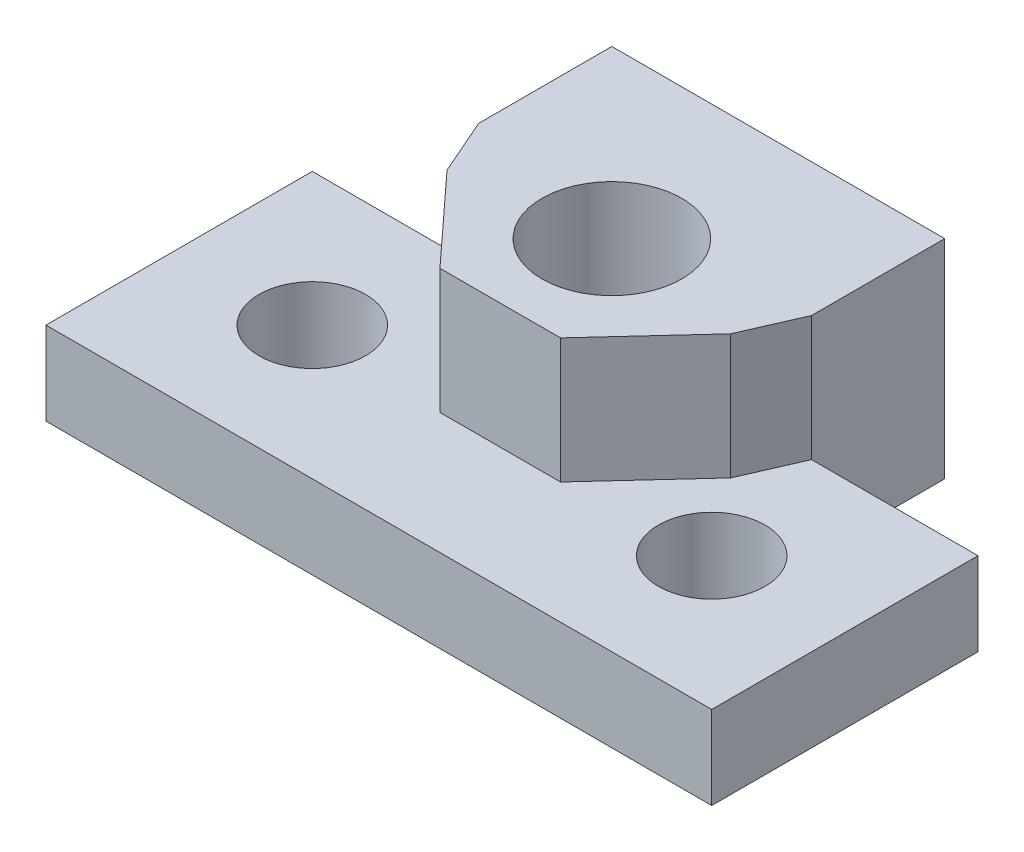
ISO-10303-21;
HEADER;
FILE_DESCRIPTION(('STEP AP214'),'2;1');
FILE_NAME('part.step','',(''),(''),'','','');
FILE_SCHEMA(('AUTOMOTIVE_DESIGN { 1 0 10303 214 1 1 1 1 }'));
ENDSEC;
DATA;
#1=APPLICATION_CONTEXT('core data for automotive mechanical design processes');
#2=APPLICATION_PROTOCOL_DEFINITION('international standard','automotive_design',2000,#1);
#3=PRODUCT_CONTEXT('',#1,'mechanical');
#4=PRODUCT('Part','Part','',(#3));
#5=PRODUCT_RELATED_PRODUCT_CATEGORY('part','',(#4));
#6=PRODUCT_DEFINITION_FORMATION('','',#4);
#7=PRODUCT_DEFINITION_CONTEXT('part definition',#1,'design');
#8=PRODUCT_DEFINITION('design','',#6,#7);
#9=PRODUCT_DEFINITION_SHAPE('','',#8);
#10=(LENGTH_UNIT() NAMED_UNIT(*) SI_UNIT(.MILLI.,.METRE.));
#11=(NAMED_UNIT(*) PLANE_ANGLE_UNIT() SI_UNIT($,.RADIAN.));
#12=(NAMED_UNIT(*) SI_UNIT($,.STERADIAN.) SOLID_ANGLE_UNIT());
#13=UNCERTAINTY_MEASURE_WITH_UNIT(LENGTH_MEASURE(1.E-05),#10,'distance_accuracy_value','');
#14=(GEOMETRIC_REPRESENTATION_CONTEXT(3) GLOBAL_UNCERTAINTY_ASSIGNED_CONTEXT((#13)) GLOBAL_UNIT_ASSIGNED_CONTEXT((#10,
#11,#12)) REPRESENTATION_CONTEXT('',''));
#15=CARTESIAN_POINT('',(0.,0.,0.));
#16=DIRECTION('',(0.,0.,1.));
#17=DIRECTION('',(1.,0.,0.));
#18=AXIS2_PLACEMENT_3D('',#15,#16,#17);
#19=CARTESIAN_POINT('',(0.,1.25,0.));
#20=DIRECTION('',(0.,1.,0.));
#21=DIRECTION('',(0.,0.,1.));
#22=AXIS2_PLACEMENT_3D('',#19,#20,#21);
#23=PLANE('',#22);
#24=CARTESIAN_POINT('',(-6.,1.25,5.66666666666666));
#25=DIRECTION('',(0.,1.,0.));
#26=DIRECTION('',(0.,0.,1.));
#27=AXIS2_PLACEMENT_3D('',#24,#25,#26);
#28=CIRCLE('',#27,1.6);
#29=CARTESIAN_POINT('',(-6.,1.25,7.26666666666666));
#30=VERTEX_POINT('',#29);
#31=EDGE_CURVE('E197',#30,#30,#28,.T.);
#32=ORIENTED_EDGE('',*,*,#31,.F.);
#33=EDGE_LOOP('',(#32));
#34=FACE_BOUND('',#33,.T.);
#35=CARTESIAN_POINT('',(6.,1.25,5.66666666666666));
#36=DIRECTION('',(0.,1.,0.));
#37=DIRECTION('',(0.,0.,1.));
#38=AXIS2_PLACEMENT_3D('',#35,#36,#37);
#39=CIRCLE('',#38,1.6);
#40=CARTESIAN_POINT('',(6.,1.25,7.26666666666666));
#41=VERTEX_POINT('',#40);
#42=EDGE_CURVE('E191',#41,#41,#39,.T.);
#43=ORIENTED_EDGE('',*,*,#42,.F.);
#44=EDGE_LOOP('',(#43));
#45=FACE_BOUND('',#44,.T.);
#46=DIRECTION('',(-0.677056530820883,0.,-0.73593101176183));
#47=VECTOR('',#46,1.);
#48=CARTESIAN_POINT('',(-3.9806682086731,1.25,3.66221475197925));
#49=LINE('',#48,#47);
#50=CARTESIAN_POINT('',(-1.81082534023711,1.25,6.0207396089749));
#51=VERTEX_POINT('',#50);
#52=CARTESIAN_POINT('',(-4.26076550644025,1.25,3.35776116744974));
#53=VERTEX_POINT('',#52);
#54=EDGE_CURVE('E11',#51,#53,#49,.T.);
#55=ORIENTED_EDGE('',*,*,#54,.T.);
#56=DIRECTION('',(-0.400537147265651,0.,-0.916280521270803));
#57=VECTOR('',#56,1.);
#58=CARTESIAN_POINT('',(-4.80952394510962,1.25,2.10240527432396));
#59=LINE('',#58,#57);
#60=CARTESIAN_POINT('',(-5.,1.25,1.66666666666666));
#61=VERTEX_POINT('',#60);
#62=EDGE_CURVE('E185',#53,#61,#59,.T.);
#63=ORIENTED_EDGE('',*,*,#62,.T.);
#64=DIRECTION('',(-1.,0.,0.));
#65=VECTOR('',#64,1.);
#66=CARTESIAN_POINT('',(-5.,1.25,1.66666666666666));
#67=LINE('',#66,#65);
#68=CARTESIAN_POINT('',(-10.,1.25,1.66666666666666));
#69=VERTEX_POINT('',#68);
#70=EDGE_CURVE('E203',#61,#69,#67,.T.);
#71=ORIENTED_EDGE('',*,*,#70,.T.);
#72=DIRECTION('',(0.,0.,1.));
#73=VECTOR('',#72,1.);
#74=CARTESIAN_POINT('',(-10.,1.25,1.66666666666666));
#75=LINE('',#74,#73);
#76=CARTESIAN_POINT('',(-10.,1.25,9.66666666666666));
#77=VERTEX_POINT('',#76);
#78=EDGE_CURVE('E205',#69,#77,#75,.T.);
#79=ORIENTED_EDGE('',*,*,#78,.T.);
#80=DIRECTION('',(1.,0.,0.));
#81=VECTOR('',#80,1.);
#82=CARTESIAN_POINT('',(-10.,1.25,9.66666666666666));
#83=LINE('',#82,#81);
#84=CARTESIAN_POINT('',(10.,1.25,9.66666666666666));
#85=VERTEX_POINT('',#84);
#86=EDGE_CURVE('E207',#77,#85,#83,.T.);
#87=ORIENTED_EDGE('',*,*,#86,.T.);
#88=DIRECTION('',(0.,0.,-1.));
#89=VECTOR('',#88,1.);
#90=CARTESIAN_POINT('',(10.,1.25,9.66666666666666));
#91=LINE('',#90,#89);
#92=CARTESIAN_POINT('',(10.,1.25,1.66666666666666));
#93=VERTEX_POINT('',#92);
#94=EDGE_CURVE('E209',#85,#93,#91,.T.);
#95=ORIENTED_EDGE('',*,*,#94,.T.);
#96=DIRECTION('',(-1.,0.,0.));
#97=VECTOR('',#96,1.);
#98=CARTESIAN_POINT('',(10.,1.25,1.66666666666666));
#99=LINE('',#98,#97);
#100=CARTESIAN_POINT('',(5.,1.25,1.66666666666666));
#101=VERTEX_POINT('',#100);
#102=EDGE_CURVE('E134',#93,#101,#99,.T.);
#103=ORIENTED_EDGE('',*,*,#102,.T.);
#104=DIRECTION('',(-0.400537147265651,0.,0.916280521270803));
#105=VECTOR('',#104,1.);
#106=CARTESIAN_POINT('',(4.80952394510962,1.25,2.10240527432396));
#107=LINE('',#106,#105);
#108=CARTESIAN_POINT('',(4.26076550644025,1.25,3.35776116744974));
#109=VERTEX_POINT('',#108);
#110=EDGE_CURVE('E183',#101,#109,#107,.T.);
#111=ORIENTED_EDGE('',*,*,#110,.T.);
#112=DIRECTION('',(-0.677056530820883,0.,0.73593101176183));
#113=VECTOR('',#112,1.);
#114=CARTESIAN_POINT('',(3.9806682086731,1.25,3.66221475197925));
#115=LINE('',#114,#113);
#116=CARTESIAN_POINT('',(1.81082534023711,1.25,6.0207396089749));
#117=VERTEX_POINT('',#116);
#118=EDGE_CURVE('E248',#109,#117,#115,.T.);
#119=ORIENTED_EDGE('',*,*,#118,.T.);
#120=DIRECTION('',(-1.,0.,0.));
#121=VECTOR('',#120,1.);
#122=CARTESIAN_POINT('',(0.,1.25,6.0207396089749));
#123=LINE('',#122,#121);
#124=EDGE_CURVE('E41',#117,#51,#123,.T.);
#125=ORIENTED_EDGE('',*,*,#124,.T.);
#126=EDGE_LOOP('',(#55,#63,#71,#79,#87,#95,#103,#111,#119,#125));
#127=FACE_BOUND('',#126,.T.);
#128=ADVANCED_FACE('F33',(#34,#45,#127),#23,.T.);
#129=CARTESIAN_POINT('',(0.,-1.25,0.));
#130=DIRECTION('',(0.,1.,0.));
#131=DIRECTION('',(0.,0.,1.));
#132=AXIS2_PLACEMENT_3D('',#129,#130,#131);
#133=PLANE('',#132);
#134=DIRECTION('',(0.,0.,1.));
#135=VECTOR('',#134,1.);
#136=CARTESIAN_POINT('',(-5.,-1.25,1.66666666666666));
#137=LINE('',#136,#135);
#138=CARTESIAN_POINT('',(-5.,-1.25,-2.33333333333334));
#139=VERTEX_POINT('',#138);
#140=CARTESIAN_POINT('',(-5.,-1.25,1.66666666666666));
#141=VERTEX_POINT('',#140);
#142=EDGE_CURVE('E200',#139,#141,#137,.T.);
#143=ORIENTED_EDGE('',*,*,#142,.F.);
#144=DIRECTION('',(-1.,0.,0.));
#145=VECTOR('',#144,1.);
#146=CARTESIAN_POINT('',(5.,-1.25,-2.33333333333334));
#147=LINE('',#146,#145);
#148=CARTESIAN_POINT('',(5.,-1.25,-2.33333333333334));
#149=VERTEX_POINT('',#148);
#150=EDGE_CURVE('E129',#149,#139,#147,.T.);
#151=ORIENTED_EDGE('',*,*,#150,.F.);
#152=DIRECTION('',(0.,0.,-1.));
#153=VECTOR('',#152,1.);
#154=CARTESIAN_POINT('',(5.,-1.25,1.66666666666666));
#155=LINE('',#154,#153);
#156=CARTESIAN_POINT('',(5.,-1.25,1.66666666666666));
#157=VERTEX_POINT('',#156);
#158=EDGE_CURVE('E224',#157,#149,#155,.T.);
#159=ORIENTED_EDGE('',*,*,#158,.F.);
#160=DIRECTION('',(-1.,0.,0.));
#161=VECTOR('',#160,1.);
#162=CARTESIAN_POINT('',(10.,-1.25,1.66666666666666));
#163=LINE('',#162,#161);
#164=CARTESIAN_POINT('',(10.,-1.25,1.66666666666666));
#165=VERTEX_POINT('',#164);
#166=EDGE_CURVE('E221',#165,#157,#163,.T.);
#167=ORIENTED_EDGE('',*,*,#166,.F.);
#168=DIRECTION('',(0.,0.,-1.));
#169=VECTOR('',#168,1.);
#170=CARTESIAN_POINT('',(10.,-1.25,9.66666666666666));
#171=LINE('',#170,#169);
#172=CARTESIAN_POINT('',(10.,-1.25,9.66666666666666));
#173=VERTEX_POINT('',#172);
#174=EDGE_CURVE('E219',#173,#165,#171,.T.);
#175=ORIENTED_EDGE('',*,*,#174,.F.);
#176=DIRECTION('',(1.,0.,0.));
#177=VECTOR('',#176,1.);
#178=CARTESIAN_POINT('',(-10.,-1.25,9.66666666666666));
#179=LINE('',#178,#177);
#180=CARTESIAN_POINT('',(-10.,-1.25,9.66666666666666));
#181=VERTEX_POINT('',#180);
#182=EDGE_CURVE('E217',#181,#173,#179,.T.);
#183=ORIENTED_EDGE('',*,*,#182,.F.);
#184=DIRECTION('',(0.,0.,1.));
#185=VECTOR('',#184,1.);
#186=CARTESIAN_POINT('',(-10.,-1.25,1.66666666666666));
#187=LINE('',#186,#185);
#188=CARTESIAN_POINT('',(-10.,-1.25,1.66666666666666));
#189=VERTEX_POINT('',#188);
#190=EDGE_CURVE('E215',#189,#181,#187,.T.);
#191=ORIENTED_EDGE('',*,*,#190,.F.);
#192=DIRECTION('',(-1.,0.,0.));
#193=VECTOR('',#192,1.);
#194=CARTESIAN_POINT('',(-5.,-1.25,1.66666666666666));
#195=LINE('',#194,#193);
#196=EDGE_CURVE('E213',#141,#189,#195,.T.);
#197=ORIENTED_EDGE('',*,*,#196,.F.);
#198=EDGE_LOOP('',(#143,#151,#159,#167,#175,#183,#191,#197));
#199=FACE_BOUND('',#198,.T.);
#200=CARTESIAN_POINT('',(-6.,-1.25,5.66666666666666));
#201=DIRECTION('',(0.,1.,0.));
#202=DIRECTION('',(0.,0.,1.));
#203=AXIS2_PLACEMENT_3D('',#200,#201,#202);
#204=CIRCLE('',#203,1.6);
#205=CARTESIAN_POINT('',(-6.,-1.25,7.26666666666666));
#206=VERTEX_POINT('',#205);
#207=EDGE_CURVE('E194',#206,#206,#204,.T.);
#208=ORIENTED_EDGE('',*,*,#207,.T.);
#209=EDGE_LOOP('',(#208));
#210=FACE_BOUND('',#209,.T.);
#211=CARTESIAN_POINT('',(6.,-1.25,5.66666666666666));
#212=DIRECTION('',(0.,1.,0.));
#213=DIRECTION('',(0.,0.,1.));
#214=AXIS2_PLACEMENT_3D('',#211,#212,#213);
#215=CIRCLE('',#214,1.6);
#216=CARTESIAN_POINT('',(6.,-1.25,7.26666666666666));
#217=VERTEX_POINT('',#216);
#218=EDGE_CURVE('E190',#217,#217,#215,.T.);
#219=ORIENTED_EDGE('',*,*,#218,.T.);
#220=EDGE_LOOP('',(#219));
#221=FACE_BOUND('',#220,.T.);
#222=CARTESIAN_POINT('',(0.,-1.25,2.66666666666666));
#223=DIRECTION('',(0.,1.,0.));
#224=DIRECTION('',(0.,0.,1.));
#225=AXIS2_PLACEMENT_3D('',#222,#223,#224);
#226=CIRCLE('',#225,2.5);
#227=CARTESIAN_POINT('',(0.,-1.25,5.16666666666666));
#228=VERTEX_POINT('',#227);
#229=EDGE_CURVE('E187',#228,#228,#226,.T.);
#230=ORIENTED_EDGE('',*,*,#229,.T.);
#231=EDGE_LOOP('',(#230));
#232=FACE_BOUND('',#231,.T.);
#233=ADVANCED_FACE('F275',(#199,#210,#221,#232),#133,.F.);
#234=CARTESIAN_POINT('',(-5.,1.25,1.66666666666666));
#235=DIRECTION('',(1.,0.,0.));
#236=DIRECTION('',(0.,0.,-1.));
#237=AXIS2_PLACEMENT_3D('',#234,#235,#236);
#238=PLANE('',#237);
#239=ORIENTED_EDGE('',*,*,#142,.T.);
#240=DIRECTION('',(0.,-1.,0.));
#241=VECTOR('',#240,1.);
#242=CARTESIAN_POINT('',(-5.,1.25,1.66666666666666));
#243=LINE('',#242,#241);
#244=EDGE_CURVE('E243',#61,#141,#243,.T.);
#245=ORIENTED_EDGE('',*,*,#244,.F.);
#246=DIRECTION('',(0.,-1.,0.));
#247=VECTOR('',#246,1.);
#248=CARTESIAN_POINT('',(-5.,5.,1.66666666666666));
#249=LINE('',#248,#247);
#250=CARTESIAN_POINT('',(-5.,5.,1.66666666666666));
#251=VERTEX_POINT('',#250);
#252=EDGE_CURVE('E140',#251,#61,#249,.T.);
#253=ORIENTED_EDGE('',*,*,#252,.F.);
#254=DIRECTION('',(0.,0.,1.));
#255=VECTOR('',#254,1.);
#256=CARTESIAN_POINT('',(-5.,5.,-2.33333333333334));
#257=LINE('',#256,#255);
#258=CARTESIAN_POINT('',(-5.,5.,-2.33333333333334));
#259=VERTEX_POINT('',#258);
#260=EDGE_CURVE('E137',#259,#251,#257,.T.);
#261=ORIENTED_EDGE('',*,*,#260,.F.);
#262=DIRECTION('',(0.,-1.,0.));
#263=VECTOR('',#262,1.);
#264=CARTESIAN_POINT('',(-5.,1.25,-2.33333333333334));
#265=LINE('',#264,#263);
#266=EDGE_CURVE('E123',#259,#139,#265,.T.);
#267=ORIENTED_EDGE('',*,*,#266,.T.);
#268=EDGE_LOOP('',(#239,#245,#253,#261,#267));
#269=FACE_BOUND('',#268,.T.);
#270=ADVANCED_FACE('F35',(#269),#238,.F.);
#271=CARTESIAN_POINT('',(-5.,1.25,1.66666666666666));
#272=DIRECTION('',(0.,0.,1.));
#273=DIRECTION('',(1.,0.,0.));
#274=AXIS2_PLACEMENT_3D('',#271,#272,#273);
#275=PLANE('',#274);
#276=ORIENTED_EDGE('',*,*,#196,.T.);
#277=DIRECTION('',(0.,-1.,0.));
#278=VECTOR('',#277,1.);
#279=CARTESIAN_POINT('',(-10.,1.25,1.66666666666666));
#280=LINE('',#279,#278);
#281=EDGE_CURVE('E240',#69,#189,#280,.T.);
#282=ORIENTED_EDGE('',*,*,#281,.F.);
#283=ORIENTED_EDGE('',*,*,#70,.F.);
#284=ORIENTED_EDGE('',*,*,#244,.T.);
#285=EDGE_LOOP('',(#276,#282,#283,#284));
#286=FACE_BOUND('',#285,.T.);
#287=ADVANCED_FACE('F271',(#286),#275,.F.);
#288=CARTESIAN_POINT('',(-10.,1.25,1.66666666666666));
#289=DIRECTION('',(1.,0.,0.));
#290=DIRECTION('',(0.,0.,-1.));
#291=AXIS2_PLACEMENT_3D('',#288,#289,#290);
#292=PLANE('',#291);
#293=ORIENTED_EDGE('',*,*,#190,.T.);
#294=DIRECTION('',(0.,-1.,0.));
#295=VECTOR('',#294,1.);
#296=CARTESIAN_POINT('',(-10.,1.25,9.66666666666666));
#297=LINE('',#296,#295);
#298=EDGE_CURVE('E237',#77,#181,#297,.T.);
#299=ORIENTED_EDGE('',*,*,#298,.F.);
#300=ORIENTED_EDGE('',*,*,#78,.F.);
#301=ORIENTED_EDGE('',*,*,#281,.T.);
#302=EDGE_LOOP('',(#293,#299,#300,#301));
#303=FACE_BOUND('',#302,.T.);
#304=ADVANCED_FACE('F281',(#303),#292,.F.);
#305=CARTESIAN_POINT('',(-10.,1.25,9.66666666666666));
#306=DIRECTION('',(0.,0.,-1.));
#307=DIRECTION('',(-1.,0.,0.));
#308=AXIS2_PLACEMENT_3D('',#305,#306,#307);
#309=PLANE('',#308);
#310=ORIENTED_EDGE('',*,*,#182,.T.);
#311=DIRECTION('',(0.,-1.,0.));
#312=VECTOR('',#311,1.);
#313=CARTESIAN_POINT('',(10.,1.25,9.66666666666666));
#314=LINE('',#313,#312);
#315=EDGE_CURVE('E234',#85,#173,#314,.T.);
#316=ORIENTED_EDGE('',*,*,#315,.F.);
#317=ORIENTED_EDGE('',*,*,#86,.F.);
#318=ORIENTED_EDGE('',*,*,#298,.T.);
#319=EDGE_LOOP('',(#310,#316,#317,#318));
#320=FACE_BOUND('',#319,.T.);
#321=ADVANCED_FACE('F288',(#320),#309,.F.);
#322=CARTESIAN_POINT('',(10.,1.25,9.66666666666666));
#323=DIRECTION('',(-1.,0.,0.));
#324=DIRECTION('',(0.,0.,1.));
#325=AXIS2_PLACEMENT_3D('',#322,#323,#324);
#326=PLANE('',#325);
#327=ORIENTED_EDGE('',*,*,#174,.T.);
#328=DIRECTION('',(0.,-1.,0.));
#329=VECTOR('',#328,1.);
#330=CARTESIAN_POINT('',(10.,1.25,1.66666666666666));
#331=LINE('',#330,#329);
#332=EDGE_CURVE('E231',#93,#165,#331,.T.);
#333=ORIENTED_EDGE('',*,*,#332,.F.);
#334=ORIENTED_EDGE('',*,*,#94,.F.);
#335=ORIENTED_EDGE('',*,*,#315,.T.);
#336=EDGE_LOOP('',(#327,#333,#334,#335));
#337=FACE_BOUND('',#336,.T.);
#338=ADVANCED_FACE('F291',(#337),#326,.F.);
#339=CARTESIAN_POINT('',(10.,1.25,1.66666666666666));
#340=DIRECTION('',(0.,0.,1.));
#341=DIRECTION('',(1.,0.,0.));
#342=AXIS2_PLACEMENT_3D('',#339,#340,#341);
#343=PLANE('',#342);
#344=ORIENTED_EDGE('',*,*,#166,.T.);
#345=DIRECTION('',(0.,-1.,0.));
#346=VECTOR('',#345,1.);
#347=CARTESIAN_POINT('',(5.,1.25,1.66666666666666));
#348=LINE('',#347,#346);
#349=EDGE_CURVE('E229',#101,#157,#348,.T.);
#350=ORIENTED_EDGE('',*,*,#349,.F.);
#351=ORIENTED_EDGE('',*,*,#102,.F.);
#352=ORIENTED_EDGE('',*,*,#332,.T.);
#353=EDGE_LOOP('',(#344,#350,#351,#352));
#354=FACE_BOUND('',#353,.T.);
#355=ADVANCED_FACE('F296',(#354),#343,.F.);
#356=CARTESIAN_POINT('',(5.,1.25,1.66666666666666));
#357=DIRECTION('',(-1.,0.,0.));
#358=DIRECTION('',(0.,0.,1.));
#359=AXIS2_PLACEMENT_3D('',#356,#357,#358);
#360=PLANE('',#359);
#361=ORIENTED_EDGE('',*,*,#158,.T.);
#362=DIRECTION('',(0.,-1.,0.));
#363=VECTOR('',#362,1.);
#364=CARTESIAN_POINT('',(5.,1.25,-2.33333333333334));
#365=LINE('',#364,#363);
#366=CARTESIAN_POINT('',(5.,5.,-2.33333333333334));
#367=VERTEX_POINT('',#366);
#368=EDGE_CURVE('E133',#367,#149,#365,.T.);
#369=ORIENTED_EDGE('',*,*,#368,.F.);
#370=DIRECTION('',(0.,0.,-1.));
#371=VECTOR('',#370,1.);
#372=CARTESIAN_POINT('',(5.,5.,-2.33333333333334));
#373=LINE('',#372,#371);
#374=CARTESIAN_POINT('',(5.,5.,1.66666666666666));
#375=VERTEX_POINT('',#374);
#376=EDGE_CURVE('E149',#375,#367,#373,.T.);
#377=ORIENTED_EDGE('',*,*,#376,.F.);
#378=DIRECTION('',(0.,-1.,0.));
#379=VECTOR('',#378,1.);
#380=CARTESIAN_POINT('',(5.,5.,1.66666666666666));
#381=LINE('',#380,#379);
#382=EDGE_CURVE('E167',#375,#101,#381,.T.);
#383=ORIENTED_EDGE('',*,*,#382,.T.);
#384=ORIENTED_EDGE('',*,*,#349,.T.);
#385=EDGE_LOOP('',(#361,#369,#377,#383,#384));
#386=FACE_BOUND('',#385,.T.);
#387=ADVANCED_FACE('F300',(#386),#360,.F.);
#388=CARTESIAN_POINT('',(5.,1.25,-2.33333333333334));
#389=DIRECTION('',(0.,0.,1.));
#390=DIRECTION('',(1.,0.,0.));
#391=AXIS2_PLACEMENT_3D('',#388,#389,#390);
#392=PLANE('',#391);
#393=ORIENTED_EDGE('',*,*,#150,.T.);
#394=ORIENTED_EDGE('',*,*,#266,.F.);
#395=DIRECTION('',(-1.,0.,0.));
#396=VECTOR('',#395,1.);
#397=CARTESIAN_POINT('',(-5.,5.,-2.33333333333334));
#398=LINE('',#397,#396);
#399=EDGE_CURVE('E127',#367,#259,#398,.T.);
#400=ORIENTED_EDGE('',*,*,#399,.F.);
#401=ORIENTED_EDGE('',*,*,#368,.T.);
#402=EDGE_LOOP('',(#393,#394,#400,#401));
#403=FACE_BOUND('',#402,.T.);
#404=ADVANCED_FACE('F125',(#403),#392,.F.);
#405=CARTESIAN_POINT('',(-6.,1.25,5.66666666666666));
#406=DIRECTION('',(0.,-1.,0.));
#407=DIRECTION('',(0.,0.,-1.));
#408=AXIS2_PLACEMENT_3D('',#405,#406,#407);
#409=CYLINDRICAL_SURFACE('',#408,1.6);
#410=ORIENTED_EDGE('',*,*,#31,.T.);
#411=EDGE_LOOP('',(#410));
#412=FACE_BOUND('',#411,.T.);
#413=ORIENTED_EDGE('',*,*,#207,.F.);
#414=EDGE_LOOP('',(#413));
#415=FACE_BOUND('',#414,.T.);
#416=ADVANCED_FACE('F307',(#412,#415),#409,.F.);
#417=CARTESIAN_POINT('',(6.,1.25,5.66666666666666));
#418=DIRECTION('',(0.,-1.,0.));
#419=DIRECTION('',(0.,0.,-1.));
#420=AXIS2_PLACEMENT_3D('',#417,#418,#419);
#421=CYLINDRICAL_SURFACE('',#420,1.6);
#422=ORIENTED_EDGE('',*,*,#42,.T.);
#423=EDGE_LOOP('',(#422));
#424=FACE_BOUND('',#423,.T.);
#425=ORIENTED_EDGE('',*,*,#218,.F.);
#426=EDGE_LOOP('',(#425));
#427=FACE_BOUND('',#426,.T.);
#428=ADVANCED_FACE('F322',(#424,#427),#421,.F.);
#429=CARTESIAN_POINT('',(0.,1.25,2.66666666666666));
#430=DIRECTION('',(0.,-1.,0.));
#431=DIRECTION('',(0.,0.,-1.));
#432=AXIS2_PLACEMENT_3D('',#429,#430,#431);
#433=CYLINDRICAL_SURFACE('',#432,2.5);
#434=CARTESIAN_POINT('',(0.,0.,2.66666666666666));
#435=DIRECTION('',(0.,-1.,0.));
#436=DIRECTION('',(0.,0.,-1.));
#437=AXIS2_PLACEMENT_3D('',#434,#435,#436);
#438=CIRCLE('',#437,2.5);
#439=CARTESIAN_POINT('',(0.,0.,0.166666666666663));
#440=VERTEX_POINT('',#439);
#441=EDGE_CURVE('E245',#440,#440,#438,.T.);
#442=ORIENTED_EDGE('',*,*,#441,.F.);
#443=EDGE_LOOP('',(#442));
#444=FACE_BOUND('',#443,.T.);
#445=ORIENTED_EDGE('',*,*,#229,.F.);
#446=EDGE_LOOP('',(#445));
#447=FACE_BOUND('',#446,.T.);
#448=ADVANCED_FACE('F326',(#444,#447),#433,.F.);
#449=CARTESIAN_POINT('',(0.,0.,0.));
#450=DIRECTION('',(0.,-1.,0.));
#451=DIRECTION('',(0.,0.,-1.));
#452=AXIS2_PLACEMENT_3D('',#449,#450,#451);
#453=PLANE('',#452);
#454=CARTESIAN_POINT('',(0.,0.,2.66666666666666));
#455=DIRECTION('',(0.,1.,0.));
#456=DIRECTION('',(0.,0.,1.));
#457=AXIS2_PLACEMENT_3D('',#454,#455,#456);
#458=CIRCLE('',#457,2.1);
#459=CARTESIAN_POINT('',(0.,0.,4.76666666666666));
#460=VERTEX_POINT('',#459);
#461=EDGE_CURVE('E153',#460,#460,#458,.T.);
#462=ORIENTED_EDGE('',*,*,#461,.T.);
#463=EDGE_LOOP('',(#462));
#464=FACE_BOUND('',#463,.T.);
#465=ORIENTED_EDGE('',*,*,#441,.T.);
#466=EDGE_LOOP('',(#465));
#467=FACE_BOUND('',#466,.T.);
#468=ADVANCED_FACE('F330',(#464,#467),#453,.T.);
#469=CARTESIAN_POINT('',(0.,5.,0.));
#470=DIRECTION('',(0.,-1.,0.));
#471=DIRECTION('',(0.,0.,-1.));
#472=AXIS2_PLACEMENT_3D('',#469,#470,#471);
#473=PLANE('',#472);
#474=ORIENTED_EDGE('',*,*,#399,.T.);
#475=ORIENTED_EDGE('',*,*,#260,.T.);
#476=DIRECTION('',(0.400537147265651,0.,0.916280521270803));
#477=VECTOR('',#476,1.);
#478=CARTESIAN_POINT('',(-5.,5.,1.66666666666666));
#479=LINE('',#478,#477);
#480=CARTESIAN_POINT('',(-4.26076550644025,5.,3.35776116744974));
#481=VERTEX_POINT('',#480);
#482=EDGE_CURVE('E143',#251,#481,#479,.T.);
#483=ORIENTED_EDGE('',*,*,#482,.T.);
#484=DIRECTION('',(0.677056530820883,0.,0.73593101176183));
#485=VECTOR('',#484,1.);
#486=CARTESIAN_POINT('',(-4.26076550644025,5.,3.35776116744974));
#487=LINE('',#486,#485);
#488=CARTESIAN_POINT('',(-1.81082534023711,5.,6.0207396089749));
#489=VERTEX_POINT('',#488);
#490=EDGE_CURVE('E158',#481,#489,#487,.T.);
#491=ORIENTED_EDGE('',*,*,#490,.T.);
#492=DIRECTION('',(1.,0.,0.));
#493=VECTOR('',#492,1.);
#494=CARTESIAN_POINT('',(-1.81082534023711,5.,6.0207396089749));
#495=LINE('',#494,#493);
#496=CARTESIAN_POINT('',(1.81082534023711,5.,6.0207396089749));
#497=VERTEX_POINT('',#496);
#498=EDGE_CURVE('E160',#489,#497,#495,.T.);
#499=ORIENTED_EDGE('',*,*,#498,.T.);
#500=DIRECTION('',(0.677056530820883,0.,-0.73593101176183));
#501=VECTOR('',#500,1.);
#502=CARTESIAN_POINT('',(4.26076550644025,5.,3.35776116744974));
#503=LINE('',#502,#501);
#504=CARTESIAN_POINT('',(4.26076550644025,5.,3.35776116744974));
#505=VERTEX_POINT('',#504);
#506=EDGE_CURVE('E162',#497,#505,#503,.T.);
#507=ORIENTED_EDGE('',*,*,#506,.T.);
#508=DIRECTION('',(0.400537147265651,0.,-0.916280521270803));
#509=VECTOR('',#508,1.);
#510=CARTESIAN_POINT('',(5.,5.,1.66666666666666));
#511=LINE('',#510,#509);
#512=EDGE_CURVE('E164',#505,#375,#511,.T.);
#513=ORIENTED_EDGE('',*,*,#512,.T.);
#514=ORIENTED_EDGE('',*,*,#376,.T.);
#515=EDGE_LOOP('',(#474,#475,#483,#491,#499,#507,#513,#514));
#516=FACE_BOUND('',#515,.T.);
#517=CARTESIAN_POINT('',(0.,5.,2.66666666666666));
#518=DIRECTION('',(0.,1.,0.));
#519=DIRECTION('',(0.,0.,1.));
#520=AXIS2_PLACEMENT_3D('',#517,#518,#519);
#521=CIRCLE('',#520,2.1);
#522=CARTESIAN_POINT('',(0.,5.,4.76666666666666));
#523=VERTEX_POINT('',#522);
#524=EDGE_CURVE('E150',#523,#523,#521,.T.);
#525=ORIENTED_EDGE('',*,*,#524,.F.);
#526=EDGE_LOOP('',(#525));
#527=FACE_BOUND('',#526,.T.);
#528=ADVANCED_FACE('F146',(#516,#527),#473,.F.);
#529=CARTESIAN_POINT('',(-5.,5.,1.66666666666666));
#530=DIRECTION('',(0.916280521270803,0.,-0.400537147265651));
#531=DIRECTION('',(-0.400537147265651,0.,-0.916280521270803));
#532=AXIS2_PLACEMENT_3D('',#529,#530,#531);
#533=PLANE('',#532);
#534=ORIENTED_EDGE('',*,*,#62,.F.);
#535=DIRECTION('',(0.,-1.,0.));
#536=VECTOR('',#535,1.);
#537=CARTESIAN_POINT('',(-4.26076550644025,5.,3.35776116744974));
#538=LINE('',#537,#536);
#539=EDGE_CURVE('E179',#481,#53,#538,.T.);
#540=ORIENTED_EDGE('',*,*,#539,.F.);
#541=ORIENTED_EDGE('',*,*,#482,.F.);
#542=ORIENTED_EDGE('',*,*,#252,.T.);
#543=EDGE_LOOP('',(#534,#540,#541,#542));
#544=FACE_BOUND('',#543,.T.);
#545=ADVANCED_FACE('F267',(#544),#533,.F.);
#546=CARTESIAN_POINT('',(-4.26076550644025,5.,3.35776116744974));
#547=DIRECTION('',(0.73593101176183,0.,-0.677056530820883));
#548=DIRECTION('',(-0.677056530820883,0.,-0.73593101176183));
#549=AXIS2_PLACEMENT_3D('',#546,#547,#548);
#550=PLANE('',#549);
#551=ORIENTED_EDGE('',*,*,#54,.F.);
#552=DIRECTION('',(0.,-1.,0.));
#553=VECTOR('',#552,1.);
#554=CARTESIAN_POINT('',(-1.81082534023711,5.,6.0207396089749));
#555=LINE('',#554,#553);
#556=EDGE_CURVE('E176',#489,#51,#555,.T.);
#557=ORIENTED_EDGE('',*,*,#556,.F.);
#558=ORIENTED_EDGE('',*,*,#490,.F.);
#559=ORIENTED_EDGE('',*,*,#539,.T.);
#560=EDGE_LOOP('',(#551,#557,#558,#559));
#561=FACE_BOUND('',#560,.T.);
#562=ADVANCED_FACE('F265',(#561),#550,.F.);
#563=CARTESIAN_POINT('',(-1.81082534023711,5.,6.0207396089749));
#564=DIRECTION('',(0.,0.,-1.));
#565=DIRECTION('',(-1.,0.,0.));
#566=AXIS2_PLACEMENT_3D('',#563,#564,#565);
#567=PLANE('',#566);
#568=ORIENTED_EDGE('',*,*,#124,.F.);
#569=DIRECTION('',(0.,-1.,0.));
#570=VECTOR('',#569,1.);
#571=CARTESIAN_POINT('',(1.81082534023711,5.,6.0207396089749));
#572=LINE('',#571,#570);
#573=EDGE_CURVE('E173',#497,#117,#572,.T.);
#574=ORIENTED_EDGE('',*,*,#573,.F.);
#575=ORIENTED_EDGE('',*,*,#498,.F.);
#576=ORIENTED_EDGE('',*,*,#556,.T.);
#577=EDGE_LOOP('',(#568,#574,#575,#576));
#578=FACE_BOUND('',#577,.T.);
#579=ADVANCED_FACE('F255',(#578),#567,.F.);
#580=CARTESIAN_POINT('',(4.26076550644025,5.,3.35776116744974));
#581=DIRECTION('',(-0.73593101176183,0.,-0.677056530820883));
#582=DIRECTION('',(-0.677056530820883,0.,0.73593101176183));
#583=AXIS2_PLACEMENT_3D('',#580,#581,#582);
#584=PLANE('',#583);
#585=ORIENTED_EDGE('',*,*,#118,.F.);
#586=DIRECTION('',(0.,-1.,0.));
#587=VECTOR('',#586,1.);
#588=CARTESIAN_POINT('',(4.26076550644025,5.,3.35776116744974));
#589=LINE('',#588,#587);
#590=EDGE_CURVE('E170',#505,#109,#589,.T.);
#591=ORIENTED_EDGE('',*,*,#590,.F.);
#592=ORIENTED_EDGE('',*,*,#506,.F.);
#593=ORIENTED_EDGE('',*,*,#573,.T.);
#594=EDGE_LOOP('',(#585,#591,#592,#593));
#595=FACE_BOUND('',#594,.T.);
#596=ADVANCED_FACE('F259',(#595),#584,.F.);
#597=CARTESIAN_POINT('',(5.,5.,1.66666666666666));
#598=DIRECTION('',(-0.916280521270803,0.,-0.400537147265651));
#599=DIRECTION('',(-0.400537147265651,0.,0.916280521270803));
#600=AXIS2_PLACEMENT_3D('',#597,#598,#599);
#601=PLANE('',#600);
#602=ORIENTED_EDGE('',*,*,#110,.F.);
#603=ORIENTED_EDGE('',*,*,#382,.F.);
#604=ORIENTED_EDGE('',*,*,#512,.F.);
#605=ORIENTED_EDGE('',*,*,#590,.T.);
#606=EDGE_LOOP('',(#602,#603,#604,#605));
#607=FACE_BOUND('',#606,.T.);
#608=ADVANCED_FACE('F299',(#607),#601,.F.);
#609=CARTESIAN_POINT('',(0.,5.,2.66666666666666));
#610=DIRECTION('',(0.,-1.,0.));
#611=DIRECTION('',(0.,0.,-1.));
#612=AXIS2_PLACEMENT_3D('',#609,#610,#611);
#613=CYLINDRICAL_SURFACE('',#612,2.1);
#614=ORIENTED_EDGE('',*,*,#524,.T.);
#615=EDGE_LOOP('',(#614));
#616=FACE_BOUND('',#615,.T.);
#617=ORIENTED_EDGE('',*,*,#461,.F.);
#618=EDGE_LOOP('',(#617));
#619=FACE_BOUND('',#618,.T.);
#620=ADVANCED_FACE('F342',(#616,#619),#613,.F.);
#621=CLOSED_SHELL('',(#128,#233,#270,#287,#304,#321,#338,#355,#387,#404,#416,#428,#448,#468,
#528,#545,#562,#579,#596,#608,#620));
#622=MANIFOLD_SOLID_BREP('B2',#621);
#623=ADVANCED_BREP_SHAPE_REPRESENTATION('',(#18,#622),#14);
#624=SHAPE_DEFINITION_REPRESENTATION(#9,#623);
ENDSEC;
END-ISO-10303-21;
